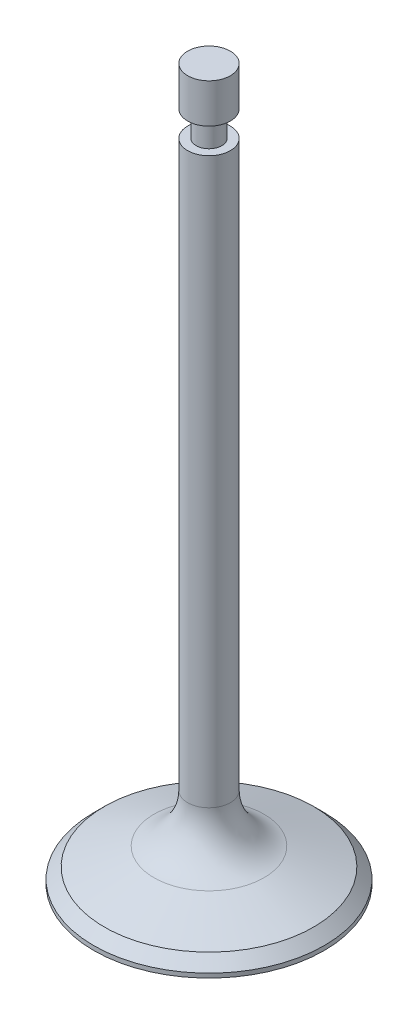
ISO-10303-21;
HEADER;
FILE_DESCRIPTION(('STEP AP214'),'2;1');
FILE_NAME('part.step','',(''),(''),'','','');
FILE_SCHEMA(('AUTOMOTIVE_DESIGN { 1 0 10303 214 1 1 1 1 }'));
ENDSEC;
DATA;
#1=APPLICATION_CONTEXT('core data for automotive mechanical design processes');
#2=APPLICATION_PROTOCOL_DEFINITION('international standard','automotive_design',2000,#1);
#3=PRODUCT_CONTEXT('',#1,'mechanical');
#4=PRODUCT('Part','Part','',(#3));
#5=PRODUCT_RELATED_PRODUCT_CATEGORY('part','',(#4));
#6=PRODUCT_DEFINITION_FORMATION('','',#4);
#7=PRODUCT_DEFINITION_CONTEXT('part definition',#1,'design');
#8=PRODUCT_DEFINITION('design','',#6,#7);
#9=PRODUCT_DEFINITION_SHAPE('','',#8);
#10=(LENGTH_UNIT() NAMED_UNIT(*) SI_UNIT(.MILLI.,.METRE.));
#11=(NAMED_UNIT(*) PLANE_ANGLE_UNIT() SI_UNIT($,.RADIAN.));
#12=(NAMED_UNIT(*) SI_UNIT($,.STERADIAN.) SOLID_ANGLE_UNIT());
#13=UNCERTAINTY_MEASURE_WITH_UNIT(LENGTH_MEASURE(1.E-05),#10,'distance_accuracy_value','');
#14=(GEOMETRIC_REPRESENTATION_CONTEXT(3) GLOBAL_UNCERTAINTY_ASSIGNED_CONTEXT((#13)) GLOBAL_UNIT_ASSIGNED_CONTEXT((#10,
#11,#12)) REPRESENTATION_CONTEXT('',''));
#15=CARTESIAN_POINT('',(0.,0.,0.));
#16=DIRECTION('',(0.,0.,1.));
#17=DIRECTION('',(1.,0.,0.));
#18=AXIS2_PLACEMENT_3D('',#15,#16,#17);
#19=CARTESIAN_POINT('',(0.,73.5249999999999,0.));
#20=DIRECTION('',(0.,-1.,0.));
#21=DIRECTION('',(1.,0.,0.));
#22=AXIS2_PLACEMENT_3D('',#19,#20,#21);
#23=SPHERICAL_SURFACE('',#22,73.5249999999999);
#24=CARTESIAN_POINT('',(0.,1.25,0.));
#25=DIRECTION('',(0.,-1.,0.));
#26=DIRECTION('',(0.,0.,-1.));
#27=AXIS2_PLACEMENT_3D('',#24,#25,#26);
#28=CIRCLE('',#27,13.5);
#29=CARTESIAN_POINT('',(0.,1.25,-13.5));
#30=VERTEX_POINT('',#29);
#31=EDGE_CURVE('E70',#30,#30,#28,.T.);
#32=ORIENTED_EDGE('',*,*,#31,.T.);
#33=EDGE_LOOP('',(#32));
#34=FACE_BOUND('',#33,.T.);
#35=ADVANCED_FACE('F36',(#34),#23,.T.);
#36=CARTESIAN_POINT('',(0.,84.495,0.));
#37=DIRECTION('',(0.,1.,0.));
#38=DIRECTION('',(0.,0.,1.));
#39=AXIS2_PLACEMENT_3D('',#36,#37,#38);
#40=PLANE('',#39);
#41=CARTESIAN_POINT('',(0.,84.495,0.));
#42=DIRECTION('',(0.,-1.,0.));
#43=DIRECTION('',(0.,0.,-1.));
#44=AXIS2_PLACEMENT_3D('',#41,#42,#43);
#45=CIRCLE('',#44,2.5);
#46=CARTESIAN_POINT('',(0.,84.495,-2.5));
#47=VERTEX_POINT('',#46);
#48=EDGE_CURVE('E10',#47,#47,#45,.T.);
#49=ORIENTED_EDGE('',*,*,#48,.F.);
#50=EDGE_LOOP('',(#49));
#51=FACE_BOUND('',#50,.T.);
#52=ADVANCED_FACE('F87',(#51),#40,.T.);
#53=CARTESIAN_POINT('',(0.,0.,0.));
#54=DIRECTION('',(0.,-1.,0.));
#55=DIRECTION('',(0.,0.,-1.));
#56=AXIS2_PLACEMENT_3D('',#53,#54,#55);
#57=CYLINDRICAL_SURFACE('',#56,2.5);
#58=ORIENTED_EDGE('',*,*,#48,.T.);
#59=EDGE_LOOP('',(#58));
#60=FACE_BOUND('',#59,.T.);
#61=CARTESIAN_POINT('',(0.,79.895,0.));
#62=DIRECTION('',(0.,-1.,0.));
#63=DIRECTION('',(0.,0.,-1.));
#64=AXIS2_PLACEMENT_3D('',#61,#62,#63);
#65=CIRCLE('',#64,2.5);
#66=CARTESIAN_POINT('',(0.,79.895,-2.5));
#67=VERTEX_POINT('',#66);
#68=EDGE_CURVE('E42',#67,#67,#65,.T.);
#69=ORIENTED_EDGE('',*,*,#68,.F.);
#70=EDGE_LOOP('',(#69));
#71=FACE_BOUND('',#70,.T.);
#72=ADVANCED_FACE('F91',(#60,#71),#57,.T.);
#73=CARTESIAN_POINT('',(2.5,79.895,0.));
#74=DIRECTION('',(0.,-1.,0.));
#75=DIRECTION('',(0.,0.,-1.));
#76=AXIS2_PLACEMENT_3D('',#73,#74,#75);
#77=PLANE('',#76);
#78=ORIENTED_EDGE('',*,*,#68,.T.);
#79=EDGE_LOOP('',(#78));
#80=FACE_BOUND('',#79,.T.);
#81=CARTESIAN_POINT('',(0.,79.895,0.));
#82=DIRECTION('',(0.,-1.,0.));
#83=DIRECTION('',(0.,0.,-1.));
#84=AXIS2_PLACEMENT_3D('',#81,#82,#83);
#85=CIRCLE('',#84,1.5);
#86=CARTESIAN_POINT('',(0.,79.895,-1.5));
#87=VERTEX_POINT('',#86);
#88=EDGE_CURVE('E46',#87,#87,#85,.T.);
#89=ORIENTED_EDGE('',*,*,#88,.F.);
#90=EDGE_LOOP('',(#89));
#91=FACE_BOUND('',#90,.T.);
#92=ADVANCED_FACE('F96',(#80,#91),#77,.T.);
#93=CARTESIAN_POINT('',(0.,0.,0.));
#94=DIRECTION('',(0.,-1.,0.));
#95=DIRECTION('',(0.,0.,-1.));
#96=AXIS2_PLACEMENT_3D('',#93,#94,#95);
#97=CYLINDRICAL_SURFACE('',#96,1.5);
#98=ORIENTED_EDGE('',*,*,#88,.T.);
#99=EDGE_LOOP('',(#98));
#100=FACE_BOUND('',#99,.T.);
#101=CARTESIAN_POINT('',(0.,76.895,0.));
#102=DIRECTION('',(0.,-1.,0.));
#103=DIRECTION('',(0.,0.,-1.));
#104=AXIS2_PLACEMENT_3D('',#101,#102,#103);
#105=CIRCLE('',#104,1.5);
#106=CARTESIAN_POINT('',(0.,76.895,-1.5));
#107=VERTEX_POINT('',#106);
#108=EDGE_CURVE('E50',#107,#107,#105,.T.);
#109=ORIENTED_EDGE('',*,*,#108,.F.);
#110=EDGE_LOOP('',(#109));
#111=FACE_BOUND('',#110,.T.);
#112=ADVANCED_FACE('F101',(#100,#111),#97,.T.);
#113=CARTESIAN_POINT('',(1.5,76.895,0.));
#114=DIRECTION('',(0.,1.,0.));
#115=DIRECTION('',(0.,0.,1.));
#116=AXIS2_PLACEMENT_3D('',#113,#114,#115);
#117=PLANE('',#116);
#118=ORIENTED_EDGE('',*,*,#108,.T.);
#119=EDGE_LOOP('',(#118));
#120=FACE_BOUND('',#119,.T.);
#121=CARTESIAN_POINT('',(0.,76.895,0.));
#122=DIRECTION('',(0.,-1.,0.));
#123=DIRECTION('',(0.,0.,-1.));
#124=AXIS2_PLACEMENT_3D('',#121,#122,#123);
#125=CIRCLE('',#124,2.5);
#126=CARTESIAN_POINT('',(0.,76.895,-2.5));
#127=VERTEX_POINT('',#126);
#128=EDGE_CURVE('E55',#127,#127,#125,.T.);
#129=ORIENTED_EDGE('',*,*,#128,.F.);
#130=EDGE_LOOP('',(#129));
#131=FACE_BOUND('',#130,.T.);
#132=ADVANCED_FACE('F104',(#120,#131),#117,.T.);
#133=CARTESIAN_POINT('',(0.,0.,0.));
#134=DIRECTION('',(0.,-1.,0.));
#135=DIRECTION('',(0.,0.,-1.));
#136=AXIS2_PLACEMENT_3D('',#133,#134,#135);
#137=CYLINDRICAL_SURFACE('',#136,2.5);
#138=ORIENTED_EDGE('',*,*,#128,.T.);
#139=EDGE_LOOP('',(#138));
#140=FACE_BOUND('',#139,.T.);
#141=CARTESIAN_POINT('',(0.,10.7499550133537,0.));
#142=DIRECTION('',(0.,-1.,0.));
#143=DIRECTION('',(0.,0.,-1.));
#144=AXIS2_PLACEMENT_3D('',#141,#142,#143);
#145=CIRCLE('',#144,2.50000000000001);
#146=CARTESIAN_POINT('',(0.,10.7499550133537,-2.50000000000001));
#147=VERTEX_POINT('',#146);
#148=EDGE_CURVE('E58',#147,#147,#145,.T.);
#149=ORIENTED_EDGE('',*,*,#148,.F.);
#150=EDGE_LOOP('',(#149));
#151=FACE_BOUND('',#150,.T.);
#152=ADVANCED_FACE('F108',(#140,#151),#137,.T.);
#153=CARTESIAN_POINT('',(0.,10.7499550133537,0.));
#154=DIRECTION('',(0.,-1.,0.));
#155=DIRECTION('',(0.,0.,-1.));
#156=AXIS2_PLACEMENT_3D('',#153,#154,#155);
#157=TOROIDAL_SURFACE('',#156,8.50000000000001,6.);
#158=ORIENTED_EDGE('',*,*,#148,.T.);
#159=EDGE_LOOP('',(#158));
#160=FACE_BOUND('',#159,.T.);
#161=CARTESIAN_POINT('',(0.,5.11179928863822,0.));
#162=DIRECTION('',(0.,-1.,0.));
#163=DIRECTION('',(0.,0.,-1.));
#164=AXIS2_PLACEMENT_3D('',#161,#162,#163);
#165=CIRCLE('',#164,6.44787914004603);
#166=CARTESIAN_POINT('',(0.,5.11179928863822,-6.44787914004603));
#167=VERTEX_POINT('',#166);
#168=EDGE_CURVE('E61',#167,#167,#165,.T.);
#169=ORIENTED_EDGE('',*,*,#168,.F.);
#170=EDGE_LOOP('',(#169));
#171=FACE_BOUND('',#170,.T.);
#172=ADVANCED_FACE('F112',(#160,#171),#157,.F.);
#173=CARTESIAN_POINT('',(0.,3.,0.));
#174=DIRECTION('',(0.,-1.,0.));
#175=DIRECTION('',(0.,0.,-1.));
#176=AXIS2_PLACEMENT_3D('',#173,#174,#175);
#177=CONICAL_SURFACE('',#176,12.25,1.22173047639604);
#178=ORIENTED_EDGE('',*,*,#168,.T.);
#179=EDGE_LOOP('',(#178));
#180=FACE_BOUND('',#179,.T.);
#181=CARTESIAN_POINT('',(0.,3.,0.));
#182=DIRECTION('',(0.,-1.,0.));
#183=DIRECTION('',(0.,0.,-1.));
#184=AXIS2_PLACEMENT_3D('',#181,#182,#183);
#185=CIRCLE('',#184,12.25);
#186=CARTESIAN_POINT('',(0.,3.,-12.25));
#187=VERTEX_POINT('',#186);
#188=EDGE_CURVE('E64',#187,#187,#185,.T.);
#189=ORIENTED_EDGE('',*,*,#188,.F.);
#190=EDGE_LOOP('',(#189));
#191=FACE_BOUND('',#190,.T.);
#192=ADVANCED_FACE('F83',(#180,#191),#177,.T.);
#193=CARTESIAN_POINT('',(0.,1.75,0.));
#194=DIRECTION('',(0.,-1.,0.));
#195=DIRECTION('',(0.,0.,-1.));
#196=AXIS2_PLACEMENT_3D('',#193,#194,#195);
#197=CONICAL_SURFACE('',#196,13.5,0.785398163397449);
#198=ORIENTED_EDGE('',*,*,#188,.T.);
#199=EDGE_LOOP('',(#198));
#200=FACE_BOUND('',#199,.T.);
#201=CARTESIAN_POINT('',(0.,1.75,0.));
#202=DIRECTION('',(0.,-1.,0.));
#203=DIRECTION('',(0.,0.,-1.));
#204=AXIS2_PLACEMENT_3D('',#201,#202,#203);
#205=CIRCLE('',#204,13.5);
#206=CARTESIAN_POINT('',(0.,1.75,-13.5));
#207=VERTEX_POINT('',#206);
#208=EDGE_CURVE('E67',#207,#207,#205,.T.);
#209=ORIENTED_EDGE('',*,*,#208,.F.);
#210=EDGE_LOOP('',(#209));
#211=FACE_BOUND('',#210,.T.);
#212=ADVANCED_FACE('F77',(#200,#211),#197,.T.);
#213=CARTESIAN_POINT('',(0.,0.,0.));
#214=DIRECTION('',(0.,-1.,0.));
#215=DIRECTION('',(0.,0.,-1.));
#216=AXIS2_PLACEMENT_3D('',#213,#214,#215);
#217=CYLINDRICAL_SURFACE('',#216,13.5);
#218=ORIENTED_EDGE('',*,*,#208,.T.);
#219=EDGE_LOOP('',(#218));
#220=FACE_BOUND('',#219,.T.);
#221=ORIENTED_EDGE('',*,*,#31,.F.);
#222=EDGE_LOOP('',(#221));
#223=FACE_BOUND('',#222,.T.);
#224=ADVANCED_FACE('F75',(#220,#223),#217,.T.);
#225=CLOSED_SHELL('',(#35,#52,#72,#92,#112,#132,#152,#172,#192,#212,#224));
#226=MANIFOLD_SOLID_BREP('B2',#225);
#227=ADVANCED_BREP_SHAPE_REPRESENTATION('',(#18,#226),#14);
#228=SHAPE_DEFINITION_REPRESENTATION(#9,#227);
ENDSEC;
END-ISO-10303-21;
